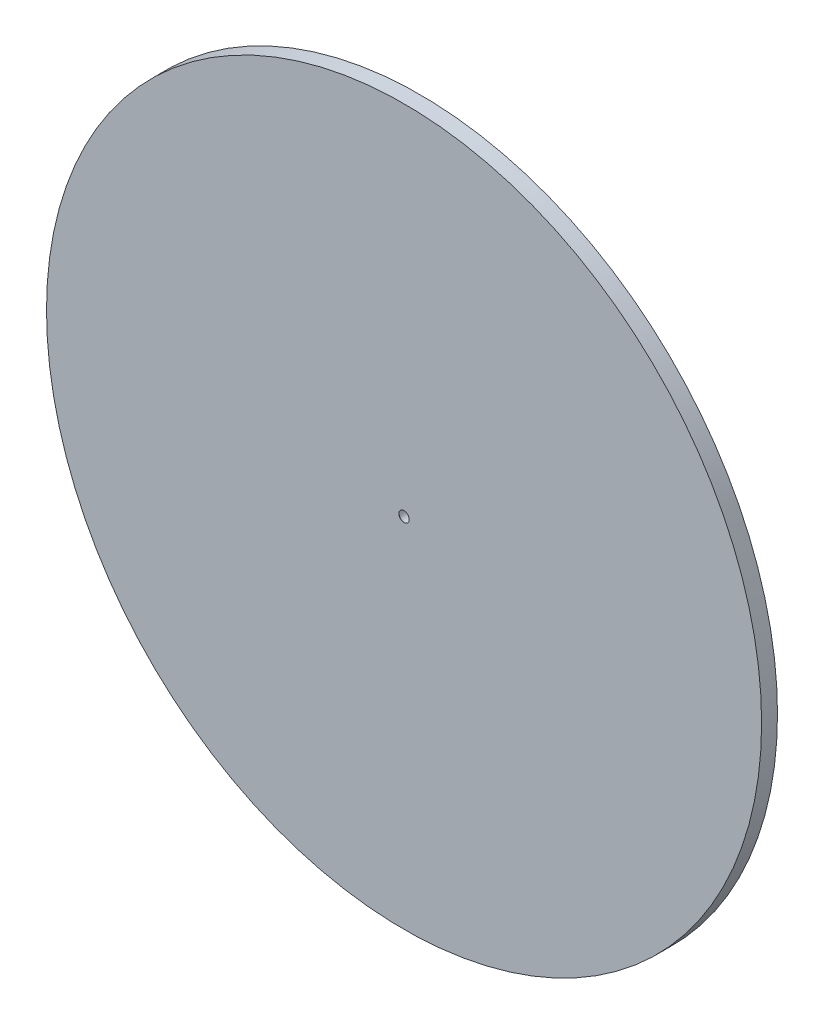
ISO-10303-21;
HEADER;
FILE_DESCRIPTION(('STEP AP214'),'2;1');
FILE_NAME('part.step','',(''),(''),'','','');
FILE_SCHEMA(('AUTOMOTIVE_DESIGN { 1 0 10303 214 1 1 1 1 }'));
ENDSEC;
DATA;
#1=APPLICATION_CONTEXT('core data for automotive mechanical design processes');
#2=APPLICATION_PROTOCOL_DEFINITION('international standard','automotive_design',2000,#1);
#3=PRODUCT_CONTEXT('',#1,'mechanical');
#4=PRODUCT('Part','Part','',(#3));
#5=PRODUCT_RELATED_PRODUCT_CATEGORY('part','',(#4));
#6=PRODUCT_DEFINITION_FORMATION('','',#4);
#7=PRODUCT_DEFINITION_CONTEXT('part definition',#1,'design');
#8=PRODUCT_DEFINITION('design','',#6,#7);
#9=PRODUCT_DEFINITION_SHAPE('','',#8);
#10=(LENGTH_UNIT() NAMED_UNIT(*) SI_UNIT(.MILLI.,.METRE.));
#11=(NAMED_UNIT(*) PLANE_ANGLE_UNIT() SI_UNIT($,.RADIAN.));
#12=(NAMED_UNIT(*) SI_UNIT($,.STERADIAN.) SOLID_ANGLE_UNIT());
#13=UNCERTAINTY_MEASURE_WITH_UNIT(LENGTH_MEASURE(1.E-05),#10,'distance_accuracy_value','');
#14=(GEOMETRIC_REPRESENTATION_CONTEXT(3) GLOBAL_UNCERTAINTY_ASSIGNED_CONTEXT((#13)) GLOBAL_UNIT_ASSIGNED_CONTEXT((#10,
#11,#12)) REPRESENTATION_CONTEXT('',''));
#15=CARTESIAN_POINT('',(0.,0.,0.));
#16=DIRECTION('',(0.,0.,1.));
#17=DIRECTION('',(1.,0.,0.));
#18=AXIS2_PLACEMENT_3D('',#15,#16,#17);
#19=CARTESIAN_POINT('',(0.,0.,2.));
#20=DIRECTION('',(0.,0.,-1.));
#21=DIRECTION('',(-1.,0.,0.));
#22=AXIS2_PLACEMENT_3D('',#19,#20,#21);
#23=CYLINDRICAL_SURFACE('',#22,45.);
#24=CARTESIAN_POINT('',(0.,0.,2.));
#25=DIRECTION('',(0.,0.,1.));
#26=DIRECTION('',(1.,0.,0.));
#27=AXIS2_PLACEMENT_3D('',#24,#25,#26);
#28=CIRCLE('',#27,45.);
#29=CARTESIAN_POINT('',(45.,0.,2.));
#30=VERTEX_POINT('',#29);
#31=EDGE_CURVE('E10',#30,#30,#28,.T.);
#32=ORIENTED_EDGE('',*,*,#31,.F.);
#33=EDGE_LOOP('',(#32));
#34=FACE_BOUND('',#33,.T.);
#35=CARTESIAN_POINT('',(0.,0.,0.));
#36=DIRECTION('',(0.,0.,1.));
#37=DIRECTION('',(1.,0.,0.));
#38=AXIS2_PLACEMENT_3D('',#35,#36,#37);
#39=CIRCLE('',#38,45.);
#40=CARTESIAN_POINT('',(45.,0.,0.));
#41=VERTEX_POINT('',#40);
#42=EDGE_CURVE('E51',#41,#41,#39,.T.);
#43=ORIENTED_EDGE('',*,*,#42,.T.);
#44=EDGE_LOOP('',(#43));
#45=FACE_BOUND('',#44,.T.);
#46=ADVANCED_FACE('F44',(#34,#45),#23,.T.);
#47=CARTESIAN_POINT('',(0.,0.,2.));
#48=DIRECTION('',(0.,0.,1.));
#49=DIRECTION('',(1.,0.,0.));
#50=AXIS2_PLACEMENT_3D('',#47,#48,#49);
#51=PLANE('',#50);
#52=CARTESIAN_POINT('',(0.,0.,2.));
#53=DIRECTION('',(0.,0.,1.));
#54=DIRECTION('',(1.,0.,0.));
#55=AXIS2_PLACEMENT_3D('',#52,#53,#54);
#56=CIRCLE('',#55,0.649999999999998);
#57=CARTESIAN_POINT('',(0.649999999999999,0.,2.));
#58=VERTEX_POINT('',#57);
#59=EDGE_CURVE('E57',#58,#58,#56,.T.);
#60=ORIENTED_EDGE('',*,*,#59,.F.);
#61=EDGE_LOOP('',(#60));
#62=FACE_BOUND('',#61,.T.);
#63=ORIENTED_EDGE('',*,*,#31,.T.);
#64=EDGE_LOOP('',(#63));
#65=FACE_BOUND('',#64,.T.);
#66=ADVANCED_FACE('F80',(#62,#65),#51,.T.);
#67=CARTESIAN_POINT('',(0.,0.,0.));
#68=DIRECTION('',(0.,0.,1.));
#69=DIRECTION('',(1.,0.,0.));
#70=AXIS2_PLACEMENT_3D('',#67,#68,#69);
#71=PLANE('',#70);
#72=CARTESIAN_POINT('',(0.,0.,0.));
#73=DIRECTION('',(0.,0.,1.));
#74=DIRECTION('',(1.,0.,0.));
#75=AXIS2_PLACEMENT_3D('',#72,#73,#74);
#76=CIRCLE('',#75,0.749999999999998);
#77=CARTESIAN_POINT('',(0.750000000000002,0.,0.));
#78=VERTEX_POINT('',#77);
#79=EDGE_CURVE('E47',#78,#78,#76,.T.);
#80=ORIENTED_EDGE('',*,*,#79,.T.);
#81=EDGE_LOOP('',(#80));
#82=FACE_BOUND('',#81,.T.);
#83=ORIENTED_EDGE('',*,*,#42,.F.);
#84=EDGE_LOOP('',(#83));
#85=FACE_BOUND('',#84,.T.);
#86=ADVANCED_FACE('F67',(#82,#85),#71,.F.);
#87=CARTESIAN_POINT('',(0.,0.,-14.4));
#88=DIRECTION('',(0.,0.,1.));
#89=DIRECTION('',(1.,0.,0.));
#90=AXIS2_PLACEMENT_3D('',#87,#88,#89);
#91=CYLINDRICAL_SURFACE('',#90,0.749999999999998);
#92=CARTESIAN_POINT('',(0.,0.,1.9));
#93=DIRECTION('',(0.,0.,1.));
#94=DIRECTION('',(1.,0.,0.));
#95=AXIS2_PLACEMENT_3D('',#92,#93,#94);
#96=CIRCLE('',#95,0.749999999999998);
#97=CARTESIAN_POINT('',(0.749999999999999,0.,1.9));
#98=VERTEX_POINT('',#97);
#99=EDGE_CURVE('E60',#98,#98,#96,.F.);
#100=ORIENTED_EDGE('',*,*,#99,.F.);
#101=EDGE_LOOP('',(#100));
#102=FACE_BOUND('',#101,.T.);
#103=ORIENTED_EDGE('',*,*,#79,.F.);
#104=EDGE_LOOP('',(#103));
#105=FACE_BOUND('',#104,.T.);
#106=ADVANCED_FACE('F70',(#102,#105),#91,.F.);
#107=CARTESIAN_POINT('',(0.,0.,2.));
#108=DIRECTION('',(0.,0.,-1.));
#109=DIRECTION('',(-1.,0.,0.));
#110=AXIS2_PLACEMENT_3D('',#107,#108,#109);
#111=CONICAL_SURFACE('',#110,0.649999999999998,0.785398163397452);
#112=ORIENTED_EDGE('',*,*,#99,.T.);
#113=EDGE_LOOP('',(#112));
#114=FACE_BOUND('',#113,.T.);
#115=ORIENTED_EDGE('',*,*,#59,.T.);
#116=EDGE_LOOP('',(#115));
#117=FACE_BOUND('',#116,.T.);
#118=ADVANCED_FACE('F72',(#114,#117),#111,.F.);
#119=CLOSED_SHELL('',(#46,#66,#86,#106,#118));
#120=MANIFOLD_SOLID_BREP('B2',#119);
#121=ADVANCED_BREP_SHAPE_REPRESENTATION('',(#18,#120),#14);
#122=SHAPE_DEFINITION_REPRESENTATION(#9,#121);
ENDSEC;
END-ISO-10303-21;
